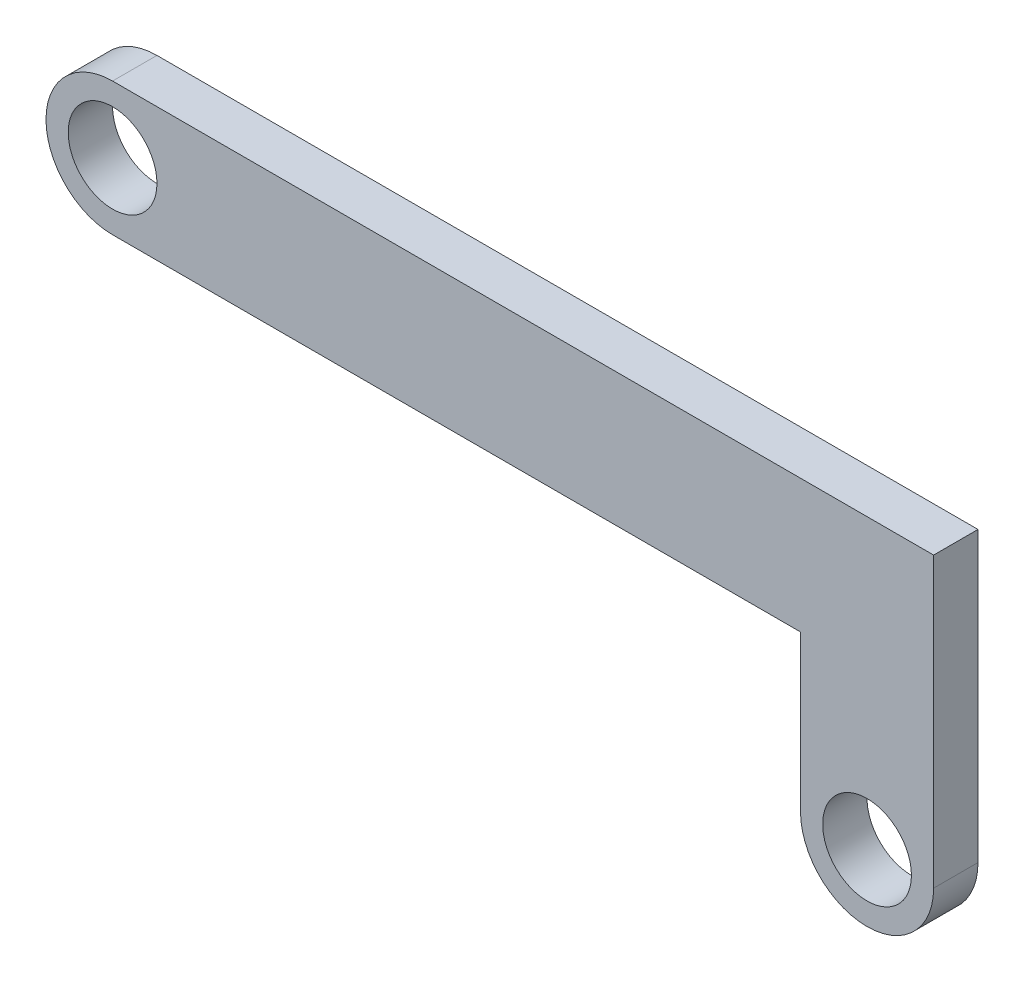
ISO-10303-21;
HEADER;
FILE_DESCRIPTION(('STEP AP214'),'2;1');
FILE_NAME('part.step','',(''),(''),'','','');
FILE_SCHEMA(('AUTOMOTIVE_DESIGN { 1 0 10303 214 1 1 1 1 }'));
ENDSEC;
DATA;
#1=APPLICATION_CONTEXT('core data for automotive mechanical design processes');
#2=APPLICATION_PROTOCOL_DEFINITION('international standard','automotive_design',2000,#1);
#3=PRODUCT_CONTEXT('',#1,'mechanical');
#4=PRODUCT('Part','Part','',(#3));
#5=PRODUCT_RELATED_PRODUCT_CATEGORY('part','',(#4));
#6=PRODUCT_DEFINITION_FORMATION('','',#4);
#7=PRODUCT_DEFINITION_CONTEXT('part definition',#1,'design');
#8=PRODUCT_DEFINITION('design','',#6,#7);
#9=PRODUCT_DEFINITION_SHAPE('','',#8);
#10=(LENGTH_UNIT() NAMED_UNIT(*) SI_UNIT(.MILLI.,.METRE.));
#11=(NAMED_UNIT(*) PLANE_ANGLE_UNIT() SI_UNIT($,.RADIAN.));
#12=(NAMED_UNIT(*) SI_UNIT($,.STERADIAN.) SOLID_ANGLE_UNIT());
#13=UNCERTAINTY_MEASURE_WITH_UNIT(LENGTH_MEASURE(1.E-05),#10,'distance_accuracy_value','');
#14=(GEOMETRIC_REPRESENTATION_CONTEXT(3) GLOBAL_UNCERTAINTY_ASSIGNED_CONTEXT((#13)) GLOBAL_UNIT_ASSIGNED_CONTEXT((#10,
#11,#12)) REPRESENTATION_CONTEXT('',''));
#15=CARTESIAN_POINT('',(0.,0.,0.));
#16=DIRECTION('',(0.,0.,1.));
#17=DIRECTION('',(1.,0.,0.));
#18=AXIS2_PLACEMENT_3D('',#15,#16,#17);
#19=CARTESIAN_POINT('',(0.,0.,5.));
#20=DIRECTION('',(0.,0.,1.));
#21=DIRECTION('',(1.,0.,0.));
#22=AXIS2_PLACEMENT_3D('',#19,#20,#21);
#23=PLANE('',#22);
#24=CARTESIAN_POINT('',(19.2166875348851,-34.3046357615894,5.));
#25=DIRECTION('',(0.,0.,1.));
#26=DIRECTION('',(1.,0.,0.));
#27=AXIS2_PLACEMENT_3D('',#24,#25,#26);
#28=CIRCLE('',#27,5.);
#29=CARTESIAN_POINT('',(24.2166875348851,-34.3046357615894,5.));
#30=VERTEX_POINT('',#29);
#31=EDGE_CURVE('E179',#30,#30,#28,.T.);
#32=ORIENTED_EDGE('',*,*,#31,.F.);
#33=EDGE_LOOP('',(#32));
#34=FACE_BOUND('',#33,.T.);
#35=CARTESIAN_POINT('',(-65.7833124651149,-9.30463576158941,5.));
#36=DIRECTION('',(0.,0.,1.));
#37=DIRECTION('',(1.,0.,0.));
#38=AXIS2_PLACEMENT_3D('',#35,#36,#37);
#39=CIRCLE('',#38,5.);
#40=CARTESIAN_POINT('',(-60.7833124651149,-9.30463576158941,5.));
#41=VERTEX_POINT('',#40);
#42=EDGE_CURVE('E200',#41,#41,#39,.T.);
#43=ORIENTED_EDGE('',*,*,#42,.F.);
#44=EDGE_LOOP('',(#43));
#45=FACE_BOUND('',#44,.T.);
#46=CARTESIAN_POINT('',(-65.7833124651149,-9.30463576158941,5.));
#47=DIRECTION('',(0.,0.,1.));
#48=DIRECTION('',(1.,0.,0.));
#49=AXIS2_PLACEMENT_3D('',#46,#47,#48);
#50=CIRCLE('',#49,7.5);
#51=CARTESIAN_POINT('',(-65.7833124651149,-1.80463576158941,5.));
#52=VERTEX_POINT('',#51);
#53=CARTESIAN_POINT('',(-65.7833124651149,-16.8046357615894,5.));
#54=VERTEX_POINT('',#53);
#55=EDGE_CURVE('E162',#52,#54,#50,.T.);
#56=ORIENTED_EDGE('',*,*,#55,.T.);
#57=DIRECTION('',(1.,0.,0.));
#58=VECTOR('',#57,1.);
#59=CARTESIAN_POINT('',(-73.2833124651149,-16.8046357615894,5.));
#60=LINE('',#59,#58);
#61=CARTESIAN_POINT('',(11.7166875348851,-16.8046357615894,5.));
#62=VERTEX_POINT('',#61);
#63=EDGE_CURVE('E167',#54,#62,#60,.T.);
#64=ORIENTED_EDGE('',*,*,#63,.T.);
#65=DIRECTION('',(0.,-1.,0.));
#66=VECTOR('',#65,1.);
#67=CARTESIAN_POINT('',(11.7166875348851,-16.8046357615894,5.));
#68=LINE('',#67,#66);
#69=CARTESIAN_POINT('',(11.7166875348851,-34.3046357615894,5.));
#70=VERTEX_POINT('',#69);
#71=EDGE_CURVE('E194',#62,#70,#68,.T.);
#72=ORIENTED_EDGE('',*,*,#71,.T.);
#73=CARTESIAN_POINT('',(19.2166875348851,-34.3046357615894,5.));
#74=DIRECTION('',(0.,0.,1.));
#75=DIRECTION('',(1.,0.,0.));
#76=AXIS2_PLACEMENT_3D('',#73,#74,#75);
#77=CIRCLE('',#76,7.5);
#78=CARTESIAN_POINT('',(26.7166875348851,-34.3046357615894,5.));
#79=VERTEX_POINT('',#78);
#80=EDGE_CURVE('E206',#70,#79,#77,.T.);
#81=ORIENTED_EDGE('',*,*,#80,.T.);
#82=DIRECTION('',(0.,1.,0.));
#83=VECTOR('',#82,1.);
#84=CARTESIAN_POINT('',(26.7166875348851,-1.80463576158941,5.));
#85=LINE('',#84,#83);
#86=CARTESIAN_POINT('',(26.7166875348851,-1.80463576158941,5.));
#87=VERTEX_POINT('',#86);
#88=EDGE_CURVE('E192',#79,#87,#85,.T.);
#89=ORIENTED_EDGE('',*,*,#88,.T.);
#90=DIRECTION('',(-1.,0.,0.));
#91=VECTOR('',#90,1.);
#92=CARTESIAN_POINT('',(-73.2833124651149,-1.80463576158941,5.));
#93=LINE('',#92,#91);
#94=EDGE_CURVE('E182',#87,#52,#93,.T.);
#95=ORIENTED_EDGE('',*,*,#94,.T.);
#96=EDGE_LOOP('',(#56,#64,#72,#81,#89,#95));
#97=FACE_BOUND('',#96,.T.);
#98=ADVANCED_FACE('F102',(#34,#45,#97),#23,.T.);
#99=CARTESIAN_POINT('',(0.,0.,0.));
#100=DIRECTION('',(0.,0.,1.));
#101=DIRECTION('',(1.,0.,0.));
#102=AXIS2_PLACEMENT_3D('',#99,#100,#101);
#103=PLANE('',#102);
#104=CARTESIAN_POINT('',(-65.7833124651149,-9.30463576158941,0.));
#105=DIRECTION('',(0.,0.,1.));
#106=DIRECTION('',(1.,0.,0.));
#107=AXIS2_PLACEMENT_3D('',#104,#105,#106);
#108=CIRCLE('',#107,5.);
#109=CARTESIAN_POINT('',(-60.7833124651149,-9.30463576158941,0.));
#110=VERTEX_POINT('',#109);
#111=EDGE_CURVE('E203',#110,#110,#108,.T.);
#112=ORIENTED_EDGE('',*,*,#111,.T.);
#113=EDGE_LOOP('',(#112));
#114=FACE_BOUND('',#113,.T.);
#115=CARTESIAN_POINT('',(19.2166875348851,-34.3046357615894,0.));
#116=DIRECTION('',(0.,0.,1.));
#117=DIRECTION('',(1.,0.,0.));
#118=AXIS2_PLACEMENT_3D('',#115,#116,#117);
#119=CIRCLE('',#118,5.);
#120=CARTESIAN_POINT('',(24.2166875348851,-34.3046357615894,0.));
#121=VERTEX_POINT('',#120);
#122=EDGE_CURVE('E174',#121,#121,#119,.T.);
#123=ORIENTED_EDGE('',*,*,#122,.T.);
#124=EDGE_LOOP('',(#123));
#125=FACE_BOUND('',#124,.T.);
#126=DIRECTION('',(1.,0.,0.));
#127=VECTOR('',#126,1.);
#128=CARTESIAN_POINT('',(-73.2833124651149,-16.8046357615894,0.));
#129=LINE('',#128,#127);
#130=CARTESIAN_POINT('',(-65.7833124651149,-16.8046357615894,0.));
#131=VERTEX_POINT('',#130);
#132=CARTESIAN_POINT('',(11.7166875348851,-16.8046357615894,0.));
#133=VERTEX_POINT('',#132);
#134=EDGE_CURVE('E166',#131,#133,#129,.T.);
#135=ORIENTED_EDGE('',*,*,#134,.F.);
#136=CARTESIAN_POINT('',(-65.7833124651149,-9.30463576158941,0.));
#137=DIRECTION('',(0.,0.,1.));
#138=DIRECTION('',(1.,0.,0.));
#139=AXIS2_PLACEMENT_3D('',#136,#137,#138);
#140=CIRCLE('',#139,7.5);
#141=CARTESIAN_POINT('',(-65.7833124651149,-1.80463576158941,0.));
#142=VERTEX_POINT('',#141);
#143=EDGE_CURVE('E153',#142,#131,#140,.T.);
#144=ORIENTED_EDGE('',*,*,#143,.F.);
#145=DIRECTION('',(-1.,0.,0.));
#146=VECTOR('',#145,1.);
#147=CARTESIAN_POINT('',(-73.2833124651149,-1.80463576158941,0.));
#148=LINE('',#147,#146);
#149=CARTESIAN_POINT('',(26.7166875348851,-1.80463576158941,0.));
#150=VERTEX_POINT('',#149);
#151=EDGE_CURVE('E186',#150,#142,#148,.T.);
#152=ORIENTED_EDGE('',*,*,#151,.F.);
#153=DIRECTION('',(0.,1.,0.));
#154=VECTOR('',#153,1.);
#155=CARTESIAN_POINT('',(26.7166875348851,-1.80463576158941,0.));
#156=LINE('',#155,#154);
#157=CARTESIAN_POINT('',(26.7166875348851,-34.3046357615894,0.));
#158=VERTEX_POINT('',#157);
#159=EDGE_CURVE('E176',#158,#150,#156,.T.);
#160=ORIENTED_EDGE('',*,*,#159,.F.);
#161=CARTESIAN_POINT('',(19.2166875348851,-34.3046357615894,0.));
#162=DIRECTION('',(0.,0.,1.));
#163=DIRECTION('',(1.,0.,0.));
#164=AXIS2_PLACEMENT_3D('',#161,#162,#163);
#165=CIRCLE('',#164,7.5);
#166=CARTESIAN_POINT('',(11.7166875348851,-34.3046357615894,0.));
#167=VERTEX_POINT('',#166);
#168=EDGE_CURVE('E212',#167,#158,#165,.T.);
#169=ORIENTED_EDGE('',*,*,#168,.F.);
#170=DIRECTION('',(0.,-1.,0.));
#171=VECTOR('',#170,1.);
#172=CARTESIAN_POINT('',(11.7166875348851,-16.8046357615894,0.));
#173=LINE('',#172,#171);
#174=EDGE_CURVE('E173',#133,#167,#173,.T.);
#175=ORIENTED_EDGE('',*,*,#174,.F.);
#176=EDGE_LOOP('',(#135,#144,#152,#160,#169,#175));
#177=FACE_BOUND('',#176,.T.);
#178=ADVANCED_FACE('F171',(#114,#125,#177),#103,.F.);
#179=CARTESIAN_POINT('',(-73.2833124651149,-16.8046357615894,5.));
#180=DIRECTION('',(0.,1.,0.));
#181=DIRECTION('',(0.,0.,1.));
#182=AXIS2_PLACEMENT_3D('',#179,#180,#181);
#183=PLANE('',#182);
#184=DIRECTION('',(0.,0.,1.));
#185=VECTOR('',#184,1.);
#186=CARTESIAN_POINT('',(-65.7833124651149,-16.8046357615894,0.));
#187=LINE('',#186,#185);
#188=EDGE_CURVE('E156',#131,#54,#187,.T.);
#189=ORIENTED_EDGE('',*,*,#188,.F.);
#190=ORIENTED_EDGE('',*,*,#134,.T.);
#191=DIRECTION('',(0.,0.,-1.));
#192=VECTOR('',#191,1.);
#193=CARTESIAN_POINT('',(11.7166875348851,-16.8046357615894,5.));
#194=LINE('',#193,#192);
#195=EDGE_CURVE('E12',#62,#133,#194,.T.);
#196=ORIENTED_EDGE('',*,*,#195,.F.);
#197=ORIENTED_EDGE('',*,*,#63,.F.);
#198=EDGE_LOOP('',(#189,#190,#196,#197));
#199=FACE_BOUND('',#198,.T.);
#200=ADVANCED_FACE('F104',(#199),#183,.F.);
#201=CARTESIAN_POINT('',(26.7166875348851,-1.80463576158941,5.));
#202=DIRECTION('',(-1.,0.,0.));
#203=DIRECTION('',(0.,0.,1.));
#204=AXIS2_PLACEMENT_3D('',#201,#202,#203);
#205=PLANE('',#204);
#206=DIRECTION('',(0.,0.,1.));
#207=VECTOR('',#206,1.);
#208=CARTESIAN_POINT('',(26.7166875348851,-34.3046357615894,0.));
#209=LINE('',#208,#207);
#210=EDGE_CURVE('E168',#158,#79,#209,.T.);
#211=ORIENTED_EDGE('',*,*,#210,.F.);
#212=ORIENTED_EDGE('',*,*,#159,.T.);
#213=DIRECTION('',(0.,0.,-1.));
#214=VECTOR('',#213,1.);
#215=CARTESIAN_POINT('',(26.7166875348851,-1.80463576158941,5.));
#216=LINE('',#215,#214);
#217=EDGE_CURVE('E110',#87,#150,#216,.T.);
#218=ORIENTED_EDGE('',*,*,#217,.F.);
#219=ORIENTED_EDGE('',*,*,#88,.F.);
#220=EDGE_LOOP('',(#211,#212,#218,#219));
#221=FACE_BOUND('',#220,.T.);
#222=ADVANCED_FACE('F220',(#221),#205,.F.);
#223=CARTESIAN_POINT('',(11.7166875348851,-16.8046357615894,5.));
#224=DIRECTION('',(1.,0.,0.));
#225=DIRECTION('',(0.,1.,0.));
#226=AXIS2_PLACEMENT_3D('',#223,#224,#225);
#227=PLANE('',#226);
#228=ORIENTED_EDGE('',*,*,#174,.T.);
#229=DIRECTION('',(0.,0.,1.));
#230=VECTOR('',#229,1.);
#231=CARTESIAN_POINT('',(11.7166875348851,-34.3046357615894,0.));
#232=LINE('',#231,#230);
#233=EDGE_CURVE('E117',#167,#70,#232,.T.);
#234=ORIENTED_EDGE('',*,*,#233,.T.);
#235=ORIENTED_EDGE('',*,*,#71,.F.);
#236=ORIENTED_EDGE('',*,*,#195,.T.);
#237=EDGE_LOOP('',(#228,#234,#235,#236));
#238=FACE_BOUND('',#237,.T.);
#239=ADVANCED_FACE('F223',(#238),#227,.F.);
#240=CARTESIAN_POINT('',(-73.2833124651149,-1.80463576158941,5.));
#241=DIRECTION('',(0.,-1.,0.));
#242=DIRECTION('',(0.,0.,-1.));
#243=AXIS2_PLACEMENT_3D('',#240,#241,#242);
#244=PLANE('',#243);
#245=ORIENTED_EDGE('',*,*,#151,.T.);
#246=DIRECTION('',(0.,0.,1.));
#247=VECTOR('',#246,1.);
#248=CARTESIAN_POINT('',(-65.7833124651149,-1.80463576158941,0.));
#249=LINE('',#248,#247);
#250=EDGE_CURVE('E125',#142,#52,#249,.T.);
#251=ORIENTED_EDGE('',*,*,#250,.T.);
#252=ORIENTED_EDGE('',*,*,#94,.F.);
#253=ORIENTED_EDGE('',*,*,#217,.T.);
#254=EDGE_LOOP('',(#245,#251,#252,#253));
#255=FACE_BOUND('',#254,.T.);
#256=ADVANCED_FACE('F221',(#255),#244,.F.);
#257=CARTESIAN_POINT('',(-65.7833124651149,-9.30463576158941,0.));
#258=DIRECTION('',(0.,0.,1.));
#259=DIRECTION('',(1.,0.,0.));
#260=AXIS2_PLACEMENT_3D('',#257,#258,#259);
#261=CYLINDRICAL_SURFACE('',#260,5.);
#262=ORIENTED_EDGE('',*,*,#111,.F.);
#263=EDGE_LOOP('',(#262));
#264=FACE_BOUND('',#263,.T.);
#265=ORIENTED_EDGE('',*,*,#42,.T.);
#266=EDGE_LOOP('',(#265));
#267=FACE_BOUND('',#266,.T.);
#268=ADVANCED_FACE('F236',(#264,#267),#261,.F.);
#269=CARTESIAN_POINT('',(-65.7833124651149,-9.30463576158941,0.));
#270=DIRECTION('',(0.,0.,1.));
#271=DIRECTION('',(1.,0.,0.));
#272=AXIS2_PLACEMENT_3D('',#269,#270,#271);
#273=CYLINDRICAL_SURFACE('',#272,7.5);
#274=ORIENTED_EDGE('',*,*,#55,.F.);
#275=ORIENTED_EDGE('',*,*,#250,.F.);
#276=ORIENTED_EDGE('',*,*,#143,.T.);
#277=ORIENTED_EDGE('',*,*,#188,.T.);
#278=EDGE_LOOP('',(#274,#275,#276,#277));
#279=FACE_BOUND('',#278,.T.);
#280=ADVANCED_FACE('F155',(#279),#273,.T.);
#281=CARTESIAN_POINT('',(19.2166875348851,-34.3046357615894,0.));
#282=DIRECTION('',(0.,0.,1.));
#283=DIRECTION('',(1.,0.,0.));
#284=AXIS2_PLACEMENT_3D('',#281,#282,#283);
#285=CYLINDRICAL_SURFACE('',#284,5.);
#286=ORIENTED_EDGE('',*,*,#122,.F.);
#287=EDGE_LOOP('',(#286));
#288=FACE_BOUND('',#287,.T.);
#289=ORIENTED_EDGE('',*,*,#31,.T.);
#290=EDGE_LOOP('',(#289));
#291=FACE_BOUND('',#290,.T.);
#292=ADVANCED_FACE('F264',(#288,#291),#285,.F.);
#293=CARTESIAN_POINT('',(19.2166875348851,-34.3046357615894,0.));
#294=DIRECTION('',(0.,0.,1.));
#295=DIRECTION('',(1.,0.,0.));
#296=AXIS2_PLACEMENT_3D('',#293,#294,#295);
#297=CYLINDRICAL_SURFACE('',#296,7.5);
#298=ORIENTED_EDGE('',*,*,#80,.F.);
#299=ORIENTED_EDGE('',*,*,#233,.F.);
#300=ORIENTED_EDGE('',*,*,#168,.T.);
#301=ORIENTED_EDGE('',*,*,#210,.T.);
#302=EDGE_LOOP('',(#298,#299,#300,#301));
#303=FACE_BOUND('',#302,.T.);
#304=ADVANCED_FACE('F217',(#303),#297,.T.);
#305=CLOSED_SHELL('',(#98,#178,#200,#222,#239,#256,#268,#280,#292,#304));
#306=MANIFOLD_SOLID_BREP('B2',#305);
#307=ADVANCED_BREP_SHAPE_REPRESENTATION('',(#18,#306),#14);
#308=SHAPE_DEFINITION_REPRESENTATION(#9,#307);
ENDSEC;
END-ISO-10303-21;
